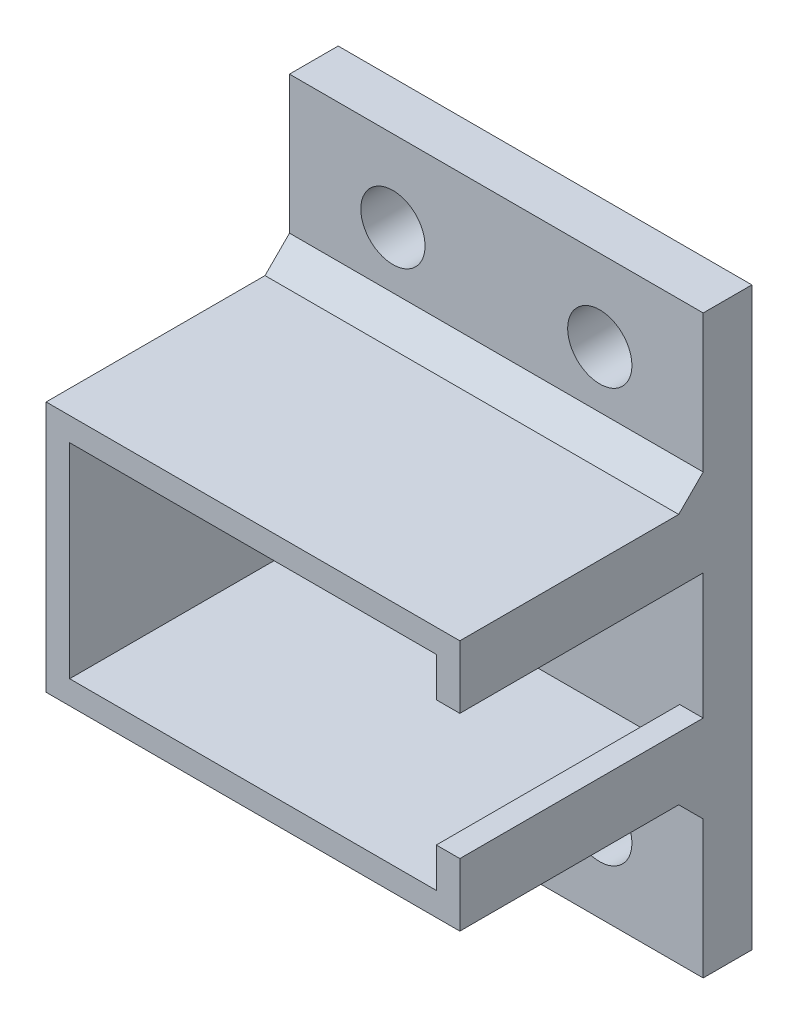
ISO-10303-21;
HEADER;
FILE_DESCRIPTION(('STEP AP214'),'2;1');
FILE_NAME('part.step','',(''),(''),'','','');
FILE_SCHEMA(('AUTOMOTIVE_DESIGN { 1 0 10303 214 1 1 1 1 }'));
ENDSEC;
DATA;
#1=APPLICATION_CONTEXT('core data for automotive mechanical design processes');
#2=APPLICATION_PROTOCOL_DEFINITION('international standard','automotive_design',2000,#1);
#3=PRODUCT_CONTEXT('',#1,'mechanical');
#4=PRODUCT('Part','Part','',(#3));
#5=PRODUCT_RELATED_PRODUCT_CATEGORY('part','',(#4));
#6=PRODUCT_DEFINITION_FORMATION('','',#4);
#7=PRODUCT_DEFINITION_CONTEXT('part definition',#1,'design');
#8=PRODUCT_DEFINITION('design','',#6,#7);
#9=PRODUCT_DEFINITION_SHAPE('','',#8);
#10=(LENGTH_UNIT() NAMED_UNIT(*) SI_UNIT(.MILLI.,.METRE.));
#11=(NAMED_UNIT(*) PLANE_ANGLE_UNIT() SI_UNIT($,.RADIAN.));
#12=(NAMED_UNIT(*) SI_UNIT($,.STERADIAN.) SOLID_ANGLE_UNIT());
#13=UNCERTAINTY_MEASURE_WITH_UNIT(LENGTH_MEASURE(1.E-05),#10,'distance_accuracy_value','');
#14=(GEOMETRIC_REPRESENTATION_CONTEXT(3) GLOBAL_UNCERTAINTY_ASSIGNED_CONTEXT((#13)) GLOBAL_UNIT_ASSIGNED_CONTEXT((#10,
#11,#12)) REPRESENTATION_CONTEXT('',''));
#15=CARTESIAN_POINT('',(0.,0.,0.));
#16=DIRECTION('',(0.,0.,1.));
#17=DIRECTION('',(1.,0.,0.));
#18=AXIS2_PLACEMENT_3D('',#15,#16,#17);
#19=CARTESIAN_POINT('',(24.0500037428116,14.0499916348984,3.));
#20=DIRECTION('',(1.,0.,0.));
#21=DIRECTION('',(0.,0.,-1.));
#22=AXIS2_PLACEMENT_3D('',#19,#20,#21);
#23=PLANE('',#22);
#24=DIRECTION('',(0.,1.,0.));
#25=VECTOR('',#24,1.);
#26=CARTESIAN_POINT('',(24.0500037428116,14.0499916348984,3.));
#27=LINE('',#26,#25);
#28=CARTESIAN_POINT('',(24.0500037428116,11.625,3.));
#29=VERTEX_POINT('',#28);
#30=CARTESIAN_POINT('',(24.0500037428116,14.0499916348984,3.));
#31=VERTEX_POINT('',#30);
#32=EDGE_CURVE('E253',#29,#31,#27,.T.);
#33=ORIENTED_EDGE('',*,*,#32,.F.);
#34=DIRECTION('',(0.,0.,1.));
#35=VECTOR('',#34,1.);
#36=CARTESIAN_POINT('',(24.0500037428116,11.625,3.));
#37=LINE('',#36,#35);
#38=CARTESIAN_POINT('',(24.0500037428116,11.625,18.));
#39=VERTEX_POINT('',#38);
#40=EDGE_CURVE('E164',#29,#39,#37,.T.);
#41=ORIENTED_EDGE('',*,*,#40,.T.);
#42=DIRECTION('',(0.,1.,0.));
#43=VECTOR('',#42,1.);
#44=CARTESIAN_POINT('',(24.0500037428116,14.0499916348984,18.));
#45=LINE('',#44,#43);
#46=CARTESIAN_POINT('',(24.0500037428116,14.0499916348984,18.));
#47=VERTEX_POINT('',#46);
#48=EDGE_CURVE('E250',#39,#47,#45,.T.);
#49=ORIENTED_EDGE('',*,*,#48,.T.);
#50=DIRECTION('',(0.,0.,1.));
#51=VECTOR('',#50,1.);
#52=CARTESIAN_POINT('',(24.0500037428116,14.0499916348984,3.));
#53=LINE('',#52,#51);
#54=EDGE_CURVE('E261',#31,#47,#53,.T.);
#55=ORIENTED_EDGE('',*,*,#54,.F.);
#56=EDGE_LOOP('',(#33,#41,#49,#55));
#57=FACE_BOUND('',#56,.T.);
#58=ADVANCED_FACE('F32',(#57),#23,.F.);
#59=CARTESIAN_POINT('',(0.,0.,18.));
#60=DIRECTION('',(0.,1.,0.));
#61=DIRECTION('',(-1.,0.,0.));
#62=AXIS2_PLACEMENT_3D('',#59,#60,#61);
#63=PLANE('',#62);
#64=DIRECTION('',(0.,0.,-1.));
#65=VECTOR('',#64,1.);
#66=CARTESIAN_POINT('',(0.,0.,18.));
#67=LINE('',#66,#65);
#68=CARTESIAN_POINT('',(0.,0.,18.));
#69=VERTEX_POINT('',#68);
#70=CARTESIAN_POINT('',(0.,0.,4.50999999999994));
#71=VERTEX_POINT('',#70);
#72=EDGE_CURVE('E294',#69,#71,#67,.T.);
#73=ORIENTED_EDGE('',*,*,#72,.T.);
#74=DIRECTION('',(-1.,0.,0.));
#75=VECTOR('',#74,1.);
#76=CARTESIAN_POINT('',(25.5,0.,4.50999999999994));
#77=LINE('',#76,#75);
#78=CARTESIAN_POINT('',(25.5,0.,4.50999999999994));
#79=VERTEX_POINT('',#78);
#80=EDGE_CURVE('E192',#79,#71,#77,.T.);
#81=ORIENTED_EDGE('',*,*,#80,.F.);
#82=DIRECTION('',(0.,0.,-1.));
#83=VECTOR('',#82,1.);
#84=CARTESIAN_POINT('',(25.5,0.,18.));
#85=LINE('',#84,#83);
#86=CARTESIAN_POINT('',(25.5,0.,18.));
#87=VERTEX_POINT('',#86);
#88=EDGE_CURVE('E11',#87,#79,#85,.T.);
#89=ORIENTED_EDGE('',*,*,#88,.F.);
#90=DIRECTION('',(1.,0.,0.));
#91=VECTOR('',#90,1.);
#92=CARTESIAN_POINT('',(0.,0.,18.));
#93=LINE('',#92,#91);
#94=EDGE_CURVE('E283',#69,#87,#93,.T.);
#95=ORIENTED_EDGE('',*,*,#94,.F.);
#96=EDGE_LOOP('',(#73,#81,#89,#95));
#97=FACE_BOUND('',#96,.T.);
#98=ADVANCED_FACE('F34',(#97),#63,.F.);
#99=CARTESIAN_POINT('',(0.,15.5,18.));
#100=DIRECTION('',(0.,-1.,0.));
#101=DIRECTION('',(1.,0.,0.));
#102=AXIS2_PLACEMENT_3D('',#99,#100,#101);
#103=PLANE('',#102);
#104=DIRECTION('',(0.,0.,-1.));
#105=VECTOR('',#104,1.);
#106=CARTESIAN_POINT('',(25.5,15.5,18.));
#107=LINE('',#106,#105);
#108=CARTESIAN_POINT('',(25.5,15.5,18.));
#109=VERTEX_POINT('',#108);
#110=CARTESIAN_POINT('',(25.5,15.5,4.51000000000003));
#111=VERTEX_POINT('',#110);
#112=EDGE_CURVE('E41',#109,#111,#107,.T.);
#113=ORIENTED_EDGE('',*,*,#112,.T.);
#114=DIRECTION('',(-1.,0.,0.));
#115=VECTOR('',#114,1.);
#116=CARTESIAN_POINT('',(25.5,15.5,4.51000000000003));
#117=LINE('',#116,#115);
#118=CARTESIAN_POINT('',(0.,15.5,4.51000000000003));
#119=VERTEX_POINT('',#118);
#120=EDGE_CURVE('E198',#111,#119,#117,.T.);
#121=ORIENTED_EDGE('',*,*,#120,.T.);
#122=DIRECTION('',(0.,0.,-1.));
#123=VECTOR('',#122,1.);
#124=CARTESIAN_POINT('',(0.,15.5,18.));
#125=LINE('',#124,#123);
#126=CARTESIAN_POINT('',(0.,15.5,18.));
#127=VERTEX_POINT('',#126);
#128=EDGE_CURVE('E299',#127,#119,#125,.T.);
#129=ORIENTED_EDGE('',*,*,#128,.F.);
#130=DIRECTION('',(-1.,0.,0.));
#131=VECTOR('',#130,1.);
#132=CARTESIAN_POINT('',(0.,15.5,18.));
#133=LINE('',#132,#131);
#134=EDGE_CURVE('E290',#109,#127,#133,.T.);
#135=ORIENTED_EDGE('',*,*,#134,.F.);
#136=EDGE_LOOP('',(#113,#121,#129,#135));
#137=FACE_BOUND('',#136,.T.);
#138=ADVANCED_FACE('F351',(#137),#103,.F.);
#139=CARTESIAN_POINT('',(25.5,0.,18.));
#140=DIRECTION('',(-1.,0.,0.));
#141=DIRECTION('',(0.,0.,1.));
#142=AXIS2_PLACEMENT_3D('',#139,#140,#141);
#143=PLANE('',#142);
#144=DIRECTION('',(0.,1.,0.));
#145=VECTOR('',#144,1.);
#146=CARTESIAN_POINT('',(25.5,0.,18.));
#147=LINE('',#146,#145);
#148=CARTESIAN_POINT('',(25.5,11.625,18.));
#149=VERTEX_POINT('',#148);
#150=EDGE_CURVE('E286',#149,#109,#147,.T.);
#151=ORIENTED_EDGE('',*,*,#150,.F.);
#152=DIRECTION('',(0.,0.,-1.));
#153=VECTOR('',#152,1.);
#154=CARTESIAN_POINT('',(25.5,11.625,18.));
#155=LINE('',#154,#153);
#156=CARTESIAN_POINT('',(25.5,11.625,3.));
#157=VERTEX_POINT('',#156);
#158=EDGE_CURVE('E181',#149,#157,#155,.T.);
#159=ORIENTED_EDGE('',*,*,#158,.T.);
#160=DIRECTION('',(0.,-1.,0.));
#161=VECTOR('',#160,1.);
#162=CARTESIAN_POINT('',(25.5,0.,3.));
#163=LINE('',#162,#161);
#164=CARTESIAN_POINT('',(25.5,3.875,3.));
#165=VERTEX_POINT('',#164);
#166=EDGE_CURVE('E171',#157,#165,#163,.T.);
#167=ORIENTED_EDGE('',*,*,#166,.T.);
#168=DIRECTION('',(0.,0.,1.));
#169=VECTOR('',#168,1.);
#170=CARTESIAN_POINT('',(25.5,3.875,18.));
#171=LINE('',#170,#169);
#172=CARTESIAN_POINT('',(25.5,3.875,18.));
#173=VERTEX_POINT('',#172);
#174=EDGE_CURVE('E157',#165,#173,#171,.T.);
#175=ORIENTED_EDGE('',*,*,#174,.T.);
#176=EDGE_CURVE('E288',#87,#173,#147,.T.);
#177=ORIENTED_EDGE('',*,*,#176,.F.);
#178=ORIENTED_EDGE('',*,*,#88,.T.);
#179=DIRECTION('',(0.,0.707106781186561,0.707106781186534));
#180=VECTOR('',#179,1.);
#181=CARTESIAN_POINT('',(25.5,-1.51,3.));
#182=LINE('',#181,#180);
#183=CARTESIAN_POINT('',(25.5,-1.51,3.));
#184=VERTEX_POINT('',#183);
#185=EDGE_CURVE('E185',#184,#79,#182,.T.);
#186=ORIENTED_EDGE('',*,*,#185,.F.);
#187=DIRECTION('',(0.,1.,0.));
#188=VECTOR('',#187,1.);
#189=CARTESIAN_POINT('',(25.5,-10.,3.));
#190=LINE('',#189,#188);
#191=CARTESIAN_POINT('',(25.5,-10.,3.));
#192=VERTEX_POINT('',#191);
#193=EDGE_CURVE('E243',#192,#184,#190,.T.);
#194=ORIENTED_EDGE('',*,*,#193,.F.);
#195=DIRECTION('',(0.,0.,1.));
#196=VECTOR('',#195,1.);
#197=CARTESIAN_POINT('',(25.5,-10.,0.));
#198=LINE('',#197,#196);
#199=CARTESIAN_POINT('',(25.5,-10.,0.));
#200=VERTEX_POINT('',#199);
#201=EDGE_CURVE('E240',#200,#192,#198,.T.);
#202=ORIENTED_EDGE('',*,*,#201,.F.);
#203=DIRECTION('',(0.,1.,0.));
#204=VECTOR('',#203,1.);
#205=CARTESIAN_POINT('',(25.5,0.,0.));
#206=LINE('',#205,#204);
#207=CARTESIAN_POINT('',(25.5,25.5,0.));
#208=VERTEX_POINT('',#207);
#209=EDGE_CURVE('E276',#200,#208,#206,.T.);
#210=ORIENTED_EDGE('',*,*,#209,.T.);
#211=DIRECTION('',(0.,0.,1.));
#212=VECTOR('',#211,1.);
#213=CARTESIAN_POINT('',(25.5,25.5,0.));
#214=LINE('',#213,#212);
#215=CARTESIAN_POINT('',(25.5,25.5,3.));
#216=VERTEX_POINT('',#215);
#217=EDGE_CURVE('E228',#208,#216,#214,.T.);
#218=ORIENTED_EDGE('',*,*,#217,.T.);
#219=CARTESIAN_POINT('',(25.5,17.01,3.));
#220=VERTEX_POINT('',#219);
#221=EDGE_CURVE('E242',#220,#216,#190,.T.);
#222=ORIENTED_EDGE('',*,*,#221,.F.);
#223=DIRECTION('',(0.,0.707106781186539,-0.707106781186556));
#224=VECTOR('',#223,1.);
#225=CARTESIAN_POINT('',(25.5,17.01,3.));
#226=LINE('',#225,#224);
#227=EDGE_CURVE('E196',#111,#220,#226,.T.);
#228=ORIENTED_EDGE('',*,*,#227,.F.);
#229=ORIENTED_EDGE('',*,*,#112,.F.);
#230=EDGE_LOOP('',(#151,#159,#167,#175,#177,#178,#186,#194,#202,#210,#218,#222,#228,#229));
#231=FACE_BOUND('',#230,.T.);
#232=ADVANCED_FACE('F180',(#231),#143,.F.);
#233=CARTESIAN_POINT('',(0.,0.,18.));
#234=DIRECTION('',(1.,0.,0.));
#235=DIRECTION('',(0.,0.,-1.));
#236=AXIS2_PLACEMENT_3D('',#233,#234,#235);
#237=PLANE('',#236);
#238=ORIENTED_EDGE('',*,*,#128,.T.);
#239=DIRECTION('',(0.,0.707106781186539,-0.707106781186556));
#240=VECTOR('',#239,1.);
#241=CARTESIAN_POINT('',(0.,17.01,3.));
#242=LINE('',#241,#240);
#243=CARTESIAN_POINT('',(0.,17.01,3.));
#244=VERTEX_POINT('',#243);
#245=EDGE_CURVE('E57',#119,#244,#242,.T.);
#246=ORIENTED_EDGE('',*,*,#245,.T.);
#247=DIRECTION('',(0.,1.,0.));
#248=VECTOR('',#247,1.);
#249=CARTESIAN_POINT('',(0.,-10.,3.));
#250=LINE('',#249,#248);
#251=CARTESIAN_POINT('',(0.,25.5,3.));
#252=VERTEX_POINT('',#251);
#253=EDGE_CURVE('E246',#244,#252,#250,.T.);
#254=ORIENTED_EDGE('',*,*,#253,.T.);
#255=DIRECTION('',(0.,0.,-1.));
#256=VECTOR('',#255,1.);
#257=CARTESIAN_POINT('',(0.,25.5,0.));
#258=LINE('',#257,#256);
#259=CARTESIAN_POINT('',(0.,25.5,0.));
#260=VERTEX_POINT('',#259);
#261=EDGE_CURVE('E222',#252,#260,#258,.T.);
#262=ORIENTED_EDGE('',*,*,#261,.T.);
#263=DIRECTION('',(0.,-1.,0.));
#264=VECTOR('',#263,1.);
#265=CARTESIAN_POINT('',(0.,0.,0.));
#266=LINE('',#265,#264);
#267=CARTESIAN_POINT('',(0.,-10.,0.));
#268=VERTEX_POINT('',#267);
#269=EDGE_CURVE('E287',#260,#268,#266,.T.);
#270=ORIENTED_EDGE('',*,*,#269,.T.);
#271=DIRECTION('',(0.,0.,-1.));
#272=VECTOR('',#271,1.);
#273=CARTESIAN_POINT('',(0.,-10.,0.));
#274=LINE('',#273,#272);
#275=CARTESIAN_POINT('',(0.,-10.,3.));
#276=VERTEX_POINT('',#275);
#277=EDGE_CURVE('E234',#276,#268,#274,.T.);
#278=ORIENTED_EDGE('',*,*,#277,.F.);
#279=CARTESIAN_POINT('',(0.,-1.51,3.));
#280=VERTEX_POINT('',#279);
#281=EDGE_CURVE('E247',#276,#280,#250,.T.);
#282=ORIENTED_EDGE('',*,*,#281,.T.);
#283=DIRECTION('',(0.,0.707106781186561,0.707106781186534));
#284=VECTOR('',#283,1.);
#285=CARTESIAN_POINT('',(0.,-1.51,3.));
#286=LINE('',#285,#284);
#287=EDGE_CURVE('E182',#280,#71,#286,.T.);
#288=ORIENTED_EDGE('',*,*,#287,.T.);
#289=ORIENTED_EDGE('',*,*,#72,.F.);
#290=DIRECTION('',(0.,-1.,0.));
#291=VECTOR('',#290,1.);
#292=CARTESIAN_POINT('',(0.,0.,18.));
#293=LINE('',#292,#291);
#294=EDGE_CURVE('E292',#127,#69,#293,.T.);
#295=ORIENTED_EDGE('',*,*,#294,.F.);
#296=EDGE_LOOP('',(#238,#246,#254,#262,#270,#278,#282,#288,#289,#295));
#297=FACE_BOUND('',#296,.T.);
#298=ADVANCED_FACE('F324',(#297),#237,.F.);
#299=CARTESIAN_POINT('',(0.,0.,18.));
#300=DIRECTION('',(0.,0.,1.));
#301=DIRECTION('',(1.,0.,0.));
#302=AXIS2_PLACEMENT_3D('',#299,#300,#301);
#303=PLANE('',#302);
#304=DIRECTION('',(1.,0.,0.));
#305=VECTOR('',#304,1.);
#306=CARTESIAN_POINT('',(16.5,11.625,18.));
#307=LINE('',#306,#305);
#308=EDGE_CURVE('E398',#39,#149,#307,.T.);
#309=ORIENTED_EDGE('',*,*,#308,.T.);
#310=ORIENTED_EDGE('',*,*,#150,.T.);
#311=ORIENTED_EDGE('',*,*,#134,.T.);
#312=ORIENTED_EDGE('',*,*,#294,.T.);
#313=ORIENTED_EDGE('',*,*,#94,.T.);
#314=ORIENTED_EDGE('',*,*,#176,.T.);
#315=DIRECTION('',(1.,0.,0.));
#316=VECTOR('',#315,1.);
#317=CARTESIAN_POINT('',(16.5,3.875,18.));
#318=LINE('',#317,#316);
#319=CARTESIAN_POINT('',(24.0500037428116,3.875,18.));
#320=VERTEX_POINT('',#319);
#321=EDGE_CURVE('E160',#320,#173,#318,.T.);
#322=ORIENTED_EDGE('',*,*,#321,.F.);
#323=CARTESIAN_POINT('',(24.0500037428116,1.44999163489811,18.));
#324=VERTEX_POINT('',#323);
#325=EDGE_CURVE('E262',#324,#320,#45,.T.);
#326=ORIENTED_EDGE('',*,*,#325,.F.);
#327=DIRECTION('',(1.,0.,0.));
#328=VECTOR('',#327,1.);
#329=CARTESIAN_POINT('',(24.0500037428116,1.44999163489811,18.));
#330=LINE('',#329,#328);
#331=CARTESIAN_POINT('',(1.45000374281136,1.44999163489811,18.));
#332=VERTEX_POINT('',#331);
#333=EDGE_CURVE('E271',#332,#324,#330,.T.);
#334=ORIENTED_EDGE('',*,*,#333,.F.);
#335=DIRECTION('',(0.,-1.,0.));
#336=VECTOR('',#335,1.);
#337=CARTESIAN_POINT('',(1.45000374281136,14.0499916348984,18.));
#338=LINE('',#337,#336);
#339=CARTESIAN_POINT('',(1.45000374281136,14.0499916348984,18.));
#340=VERTEX_POINT('',#339);
#341=EDGE_CURVE('E268',#340,#332,#338,.T.);
#342=ORIENTED_EDGE('',*,*,#341,.F.);
#343=DIRECTION('',(-1.,0.,0.));
#344=VECTOR('',#343,1.);
#345=CARTESIAN_POINT('',(24.0500037428116,14.0499916348984,18.));
#346=LINE('',#345,#344);
#347=EDGE_CURVE('E265',#47,#340,#346,.T.);
#348=ORIENTED_EDGE('',*,*,#347,.F.);
#349=ORIENTED_EDGE('',*,*,#48,.F.);
#350=EDGE_LOOP('',(#309,#310,#311,#312,#313,#314,#322,#326,#334,#342,#348,#349));
#351=FACE_BOUND('',#350,.T.);
#352=ADVANCED_FACE('F347',(#351),#303,.T.);
#353=CARTESIAN_POINT('',(0.,0.,0.));
#354=DIRECTION('',(0.,0.,1.));
#355=DIRECTION('',(1.,0.,0.));
#356=AXIS2_PLACEMENT_3D('',#353,#354,#355);
#357=PLANE('',#356);
#358=CARTESIAN_POINT('',(19.125,-5.,0.));
#359=DIRECTION('',(0.,0.,1.));
#360=DIRECTION('',(1.,0.,0.));
#361=AXIS2_PLACEMENT_3D('',#358,#359,#360);
#362=CIRCLE('',#361,1.98);
#363=CARTESIAN_POINT('',(21.105,-5.,0.));
#364=VERTEX_POINT('',#363);
#365=EDGE_CURVE('E209',#364,#364,#362,.F.);
#366=ORIENTED_EDGE('',*,*,#365,.F.);
#367=EDGE_LOOP('',(#366));
#368=FACE_BOUND('',#367,.T.);
#369=CARTESIAN_POINT('',(6.375,20.5,0.));
#370=DIRECTION('',(0.,0.,1.));
#371=DIRECTION('',(1.,0.,0.));
#372=AXIS2_PLACEMENT_3D('',#369,#370,#371);
#373=CIRCLE('',#372,1.98);
#374=CARTESIAN_POINT('',(8.355,20.5,0.));
#375=VERTEX_POINT('',#374);
#376=EDGE_CURVE('E216',#375,#375,#373,.F.);
#377=ORIENTED_EDGE('',*,*,#376,.F.);
#378=EDGE_LOOP('',(#377));
#379=FACE_BOUND('',#378,.T.);
#380=CARTESIAN_POINT('',(6.375,-5.,0.));
#381=DIRECTION('',(0.,0.,1.));
#382=DIRECTION('',(1.,0.,0.));
#383=AXIS2_PLACEMENT_3D('',#380,#381,#382);
#384=CIRCLE('',#383,1.98);
#385=CARTESIAN_POINT('',(8.355,-5.,0.));
#386=VERTEX_POINT('',#385);
#387=EDGE_CURVE('E205',#386,#386,#384,.F.);
#388=ORIENTED_EDGE('',*,*,#387,.F.);
#389=EDGE_LOOP('',(#388));
#390=FACE_BOUND('',#389,.T.);
#391=CARTESIAN_POINT('',(19.125,20.5,0.));
#392=DIRECTION('',(0.,0.,1.));
#393=DIRECTION('',(1.,0.,0.));
#394=AXIS2_PLACEMENT_3D('',#391,#392,#393);
#395=CIRCLE('',#394,1.98);
#396=CARTESIAN_POINT('',(21.105,20.5,0.));
#397=VERTEX_POINT('',#396);
#398=EDGE_CURVE('E213',#397,#397,#395,.F.);
#399=ORIENTED_EDGE('',*,*,#398,.F.);
#400=EDGE_LOOP('',(#399));
#401=FACE_BOUND('',#400,.T.);
#402=ORIENTED_EDGE('',*,*,#209,.F.);
#403=DIRECTION('',(1.,0.,0.));
#404=VECTOR('',#403,1.);
#405=CARTESIAN_POINT('',(0.,-10.,0.));
#406=LINE('',#405,#404);
#407=EDGE_CURVE('E237',#268,#200,#406,.T.);
#408=ORIENTED_EDGE('',*,*,#407,.F.);
#409=ORIENTED_EDGE('',*,*,#269,.F.);
#410=DIRECTION('',(1.,0.,0.));
#411=VECTOR('',#410,1.);
#412=CARTESIAN_POINT('',(0.,25.5,0.));
#413=LINE('',#412,#411);
#414=EDGE_CURVE('E225',#260,#208,#413,.T.);
#415=ORIENTED_EDGE('',*,*,#414,.T.);
#416=EDGE_LOOP('',(#402,#408,#409,#415));
#417=FACE_BOUND('',#416,.T.);
#418=ADVANCED_FACE('F329',(#368,#379,#390,#401,#417),#357,.F.);
#419=ORIENTED_EDGE('',*,*,#325,.T.);
#420=DIRECTION('',(0.,0.,-1.));
#421=VECTOR('',#420,1.);
#422=CARTESIAN_POINT('',(24.0500037428116,3.875,3.));
#423=LINE('',#422,#421);
#424=CARTESIAN_POINT('',(24.0500037428116,3.875,3.));
#425=VERTEX_POINT('',#424);
#426=EDGE_CURVE('E165',#320,#425,#423,.T.);
#427=ORIENTED_EDGE('',*,*,#426,.T.);
#428=CARTESIAN_POINT('',(24.0500037428116,1.44999163489811,3.));
#429=VERTEX_POINT('',#428);
#430=EDGE_CURVE('E175',#429,#425,#27,.T.);
#431=ORIENTED_EDGE('',*,*,#430,.F.);
#432=DIRECTION('',(0.,0.,1.));
#433=VECTOR('',#432,1.);
#434=CARTESIAN_POINT('',(24.0500037428116,1.44999163489811,3.));
#435=LINE('',#434,#433);
#436=EDGE_CURVE('E274',#429,#324,#435,.T.);
#437=ORIENTED_EDGE('',*,*,#436,.T.);
#438=EDGE_LOOP('',(#419,#427,#431,#437));
#439=FACE_BOUND('',#438,.T.);
#440=ADVANCED_FACE('F373',(#439),#23,.F.);
#441=CARTESIAN_POINT('',(24.0500037428116,1.44999163489811,3.));
#442=DIRECTION('',(0.,-1.,0.));
#443=DIRECTION('',(0.,0.,-1.));
#444=AXIS2_PLACEMENT_3D('',#441,#442,#443);
#445=PLANE('',#444);
#446=ORIENTED_EDGE('',*,*,#333,.T.);
#447=ORIENTED_EDGE('',*,*,#436,.F.);
#448=DIRECTION('',(1.,0.,0.));
#449=VECTOR('',#448,1.);
#450=CARTESIAN_POINT('',(24.0500037428116,1.44999163489811,3.));
#451=LINE('',#450,#449);
#452=CARTESIAN_POINT('',(1.45000374281136,1.44999163489811,3.));
#453=VERTEX_POINT('',#452);
#454=EDGE_CURVE('E259',#453,#429,#451,.T.);
#455=ORIENTED_EDGE('',*,*,#454,.F.);
#456=DIRECTION('',(0.,0.,1.));
#457=VECTOR('',#456,1.);
#458=CARTESIAN_POINT('',(1.45000374281136,1.44999163489811,3.));
#459=LINE('',#458,#457);
#460=EDGE_CURVE('E277',#453,#332,#459,.T.);
#461=ORIENTED_EDGE('',*,*,#460,.T.);
#462=EDGE_LOOP('',(#446,#447,#455,#461));
#463=FACE_BOUND('',#462,.T.);
#464=ADVANCED_FACE('F382',(#463),#445,.F.);
#465=CARTESIAN_POINT('',(1.45000374281136,14.0499916348984,3.));
#466=DIRECTION('',(-1.,0.,0.));
#467=DIRECTION('',(0.,-1.,0.));
#468=AXIS2_PLACEMENT_3D('',#465,#466,#467);
#469=PLANE('',#468);
#470=ORIENTED_EDGE('',*,*,#341,.T.);
#471=ORIENTED_EDGE('',*,*,#460,.F.);
#472=DIRECTION('',(0.,-1.,0.));
#473=VECTOR('',#472,1.);
#474=CARTESIAN_POINT('',(1.45000374281136,14.0499916348984,3.));
#475=LINE('',#474,#473);
#476=CARTESIAN_POINT('',(1.45000374281136,14.0499916348984,3.));
#477=VERTEX_POINT('',#476);
#478=EDGE_CURVE('E256',#477,#453,#475,.T.);
#479=ORIENTED_EDGE('',*,*,#478,.F.);
#480=DIRECTION('',(0.,0.,1.));
#481=VECTOR('',#480,1.);
#482=CARTESIAN_POINT('',(1.45000374281136,14.0499916348984,3.));
#483=LINE('',#482,#481);
#484=EDGE_CURVE('E279',#477,#340,#483,.T.);
#485=ORIENTED_EDGE('',*,*,#484,.T.);
#486=EDGE_LOOP('',(#470,#471,#479,#485));
#487=FACE_BOUND('',#486,.T.);
#488=ADVANCED_FACE('F389',(#487),#469,.F.);
#489=CARTESIAN_POINT('',(24.0500037428116,14.0499916348984,3.));
#490=DIRECTION('',(0.,1.,0.));
#491=DIRECTION('',(0.,0.,1.));
#492=AXIS2_PLACEMENT_3D('',#489,#490,#491);
#493=PLANE('',#492);
#494=ORIENTED_EDGE('',*,*,#347,.T.);
#495=ORIENTED_EDGE('',*,*,#484,.F.);
#496=DIRECTION('',(-1.,0.,0.));
#497=VECTOR('',#496,1.);
#498=CARTESIAN_POINT('',(24.0500037428116,14.0499916348984,3.));
#499=LINE('',#498,#497);
#500=EDGE_CURVE('E252',#31,#477,#499,.T.);
#501=ORIENTED_EDGE('',*,*,#500,.F.);
#502=ORIENTED_EDGE('',*,*,#54,.T.);
#503=EDGE_LOOP('',(#494,#495,#501,#502));
#504=FACE_BOUND('',#503,.T.);
#505=ADVANCED_FACE('F408',(#504),#493,.F.);
#506=CARTESIAN_POINT('',(0.,0.,3.));
#507=DIRECTION('',(0.,0.,-1.));
#508=DIRECTION('',(-1.,0.,0.));
#509=AXIS2_PLACEMENT_3D('',#506,#507,#508);
#510=PLANE('',#509);
#511=ORIENTED_EDGE('',*,*,#430,.T.);
#512=DIRECTION('',(1.,0.,0.));
#513=VECTOR('',#512,1.);
#514=CARTESIAN_POINT('',(16.5,3.875,3.));
#515=LINE('',#514,#513);
#516=EDGE_CURVE('E49',#425,#165,#515,.T.);
#517=ORIENTED_EDGE('',*,*,#516,.T.);
#518=ORIENTED_EDGE('',*,*,#166,.F.);
#519=DIRECTION('',(1.,0.,0.));
#520=VECTOR('',#519,1.);
#521=CARTESIAN_POINT('',(16.5,11.625,3.));
#522=LINE('',#521,#520);
#523=EDGE_CURVE('E176',#29,#157,#522,.T.);
#524=ORIENTED_EDGE('',*,*,#523,.F.);
#525=ORIENTED_EDGE('',*,*,#32,.T.);
#526=ORIENTED_EDGE('',*,*,#500,.T.);
#527=ORIENTED_EDGE('',*,*,#478,.T.);
#528=ORIENTED_EDGE('',*,*,#454,.T.);
#529=EDGE_LOOP('',(#511,#517,#518,#524,#525,#526,#527,#528));
#530=FACE_BOUND('',#529,.T.);
#531=ADVANCED_FACE('F169',(#530),#510,.F.);
#532=CARTESIAN_POINT('',(0.,25.5,0.));
#533=DIRECTION('',(0.,-1.,0.));
#534=DIRECTION('',(1.,0.,0.));
#535=AXIS2_PLACEMENT_3D('',#532,#533,#534);
#536=PLANE('',#535);
#537=DIRECTION('',(-1.,0.,0.));
#538=VECTOR('',#537,1.);
#539=CARTESIAN_POINT('',(0.,25.5,3.));
#540=LINE('',#539,#538);
#541=EDGE_CURVE('E219',#216,#252,#540,.T.);
#542=ORIENTED_EDGE('',*,*,#541,.F.);
#543=ORIENTED_EDGE('',*,*,#217,.F.);
#544=ORIENTED_EDGE('',*,*,#414,.F.);
#545=ORIENTED_EDGE('',*,*,#261,.F.);
#546=EDGE_LOOP('',(#542,#543,#544,#545));
#547=FACE_BOUND('',#546,.T.);
#548=ADVANCED_FACE('F316',(#547),#536,.F.);
#549=CARTESIAN_POINT('',(0.,-10.,3.));
#550=DIRECTION('',(0.,0.,-1.));
#551=DIRECTION('',(-1.,0.,0.));
#552=AXIS2_PLACEMENT_3D('',#549,#550,#551);
#553=PLANE('',#552);
#554=CARTESIAN_POINT('',(6.375,20.5,3.));
#555=DIRECTION('',(0.,0.,-1.));
#556=DIRECTION('',(-1.,0.,0.));
#557=AXIS2_PLACEMENT_3D('',#554,#555,#556);
#558=CIRCLE('',#557,1.98);
#559=CARTESIAN_POINT('',(4.395,20.5,3.));
#560=VERTEX_POINT('',#559);
#561=EDGE_CURVE('E36',#560,#560,#558,.F.);
#562=ORIENTED_EDGE('',*,*,#561,.F.);
#563=EDGE_LOOP('',(#562));
#564=FACE_BOUND('',#563,.T.);
#565=CARTESIAN_POINT('',(19.125,20.5,3.));
#566=DIRECTION('',(0.,0.,-1.));
#567=DIRECTION('',(-1.,0.,0.));
#568=AXIS2_PLACEMENT_3D('',#565,#566,#567);
#569=CIRCLE('',#568,1.98);
#570=CARTESIAN_POINT('',(17.145,20.5,3.));
#571=VERTEX_POINT('',#570);
#572=EDGE_CURVE('E212',#571,#571,#569,.F.);
#573=ORIENTED_EDGE('',*,*,#572,.F.);
#574=EDGE_LOOP('',(#573));
#575=FACE_BOUND('',#574,.T.);
#576=ORIENTED_EDGE('',*,*,#253,.F.);
#577=DIRECTION('',(-1.,0.,0.));
#578=VECTOR('',#577,1.);
#579=CARTESIAN_POINT('',(25.5,17.01,3.));
#580=LINE('',#579,#578);
#581=EDGE_CURVE('E200',#220,#244,#580,.T.);
#582=ORIENTED_EDGE('',*,*,#581,.F.);
#583=ORIENTED_EDGE('',*,*,#221,.T.);
#584=ORIENTED_EDGE('',*,*,#541,.T.);
#585=EDGE_LOOP('',(#576,#582,#583,#584));
#586=FACE_BOUND('',#585,.T.);
#587=ADVANCED_FACE('F312',(#564,#575,#586),#553,.F.);
#588=CARTESIAN_POINT('',(19.125,-5.,3.));
#589=DIRECTION('',(0.,0.,-1.));
#590=DIRECTION('',(-1.,0.,0.));
#591=AXIS2_PLACEMENT_3D('',#588,#589,#590);
#592=CIRCLE('',#591,1.98);
#593=CARTESIAN_POINT('',(17.145,-5.,3.));
#594=VERTEX_POINT('',#593);
#595=EDGE_CURVE('E208',#594,#594,#592,.F.);
#596=ORIENTED_EDGE('',*,*,#595,.F.);
#597=EDGE_LOOP('',(#596));
#598=FACE_BOUND('',#597,.T.);
#599=CARTESIAN_POINT('',(6.375,-5.,3.));
#600=DIRECTION('',(0.,0.,-1.));
#601=DIRECTION('',(-1.,0.,0.));
#602=AXIS2_PLACEMENT_3D('',#599,#600,#601);
#603=CIRCLE('',#602,1.98);
#604=CARTESIAN_POINT('',(4.395,-5.,3.));
#605=VERTEX_POINT('',#604);
#606=EDGE_CURVE('E202',#605,#605,#603,.F.);
#607=ORIENTED_EDGE('',*,*,#606,.F.);
#608=EDGE_LOOP('',(#607));
#609=FACE_BOUND('',#608,.T.);
#610=ORIENTED_EDGE('',*,*,#193,.T.);
#611=DIRECTION('',(-1.,0.,0.));
#612=VECTOR('',#611,1.);
#613=CARTESIAN_POINT('',(25.5,-1.51,3.));
#614=LINE('',#613,#612);
#615=EDGE_CURVE('E190',#184,#280,#614,.T.);
#616=ORIENTED_EDGE('',*,*,#615,.T.);
#617=ORIENTED_EDGE('',*,*,#281,.F.);
#618=DIRECTION('',(-1.,0.,0.));
#619=VECTOR('',#618,1.);
#620=CARTESIAN_POINT('',(0.,-10.,3.));
#621=LINE('',#620,#619);
#622=EDGE_CURVE('E231',#192,#276,#621,.T.);
#623=ORIENTED_EDGE('',*,*,#622,.F.);
#624=EDGE_LOOP('',(#610,#616,#617,#623));
#625=FACE_BOUND('',#624,.T.);
#626=ADVANCED_FACE('F315',(#598,#609,#625),#553,.F.);
#627=CARTESIAN_POINT('',(0.,-10.,0.));
#628=DIRECTION('',(0.,-1.,0.));
#629=DIRECTION('',(1.,0.,0.));
#630=AXIS2_PLACEMENT_3D('',#627,#628,#629);
#631=PLANE('',#630);
#632=ORIENTED_EDGE('',*,*,#622,.T.);
#633=ORIENTED_EDGE('',*,*,#277,.T.);
#634=ORIENTED_EDGE('',*,*,#407,.T.);
#635=ORIENTED_EDGE('',*,*,#201,.T.);
#636=EDGE_LOOP('',(#632,#633,#634,#635));
#637=FACE_BOUND('',#636,.T.);
#638=ADVANCED_FACE('F332',(#637),#631,.T.);
#639=CARTESIAN_POINT('',(6.375,-5.,18.));
#640=DIRECTION('',(0.,0.,-1.));
#641=DIRECTION('',(-1.,0.,0.));
#642=AXIS2_PLACEMENT_3D('',#639,#640,#641);
#643=CYLINDRICAL_SURFACE('',#642,1.98);
#644=ORIENTED_EDGE('',*,*,#606,.T.);
#645=EDGE_LOOP('',(#644));
#646=FACE_BOUND('',#645,.T.);
#647=ORIENTED_EDGE('',*,*,#387,.T.);
#648=EDGE_LOOP('',(#647));
#649=FACE_BOUND('',#648,.T.);
#650=ADVANCED_FACE('F425',(#646,#649),#643,.F.);
#651=CARTESIAN_POINT('',(19.125,-5.,18.));
#652=DIRECTION('',(0.,0.,-1.));
#653=DIRECTION('',(-1.,0.,0.));
#654=AXIS2_PLACEMENT_3D('',#651,#652,#653);
#655=CYLINDRICAL_SURFACE('',#654,1.98);
#656=ORIENTED_EDGE('',*,*,#595,.T.);
#657=EDGE_LOOP('',(#656));
#658=FACE_BOUND('',#657,.T.);
#659=ORIENTED_EDGE('',*,*,#365,.T.);
#660=EDGE_LOOP('',(#659));
#661=FACE_BOUND('',#660,.T.);
#662=ADVANCED_FACE('F430',(#658,#661),#655,.F.);
#663=CARTESIAN_POINT('',(19.125,20.5,18.));
#664=DIRECTION('',(0.,0.,-1.));
#665=DIRECTION('',(-1.,0.,0.));
#666=AXIS2_PLACEMENT_3D('',#663,#664,#665);
#667=CYLINDRICAL_SURFACE('',#666,1.98);
#668=ORIENTED_EDGE('',*,*,#572,.T.);
#669=EDGE_LOOP('',(#668));
#670=FACE_BOUND('',#669,.T.);
#671=ORIENTED_EDGE('',*,*,#398,.T.);
#672=EDGE_LOOP('',(#671));
#673=FACE_BOUND('',#672,.T.);
#674=ADVANCED_FACE('F309',(#670,#673),#667,.F.);
#675=CARTESIAN_POINT('',(6.375,20.5,18.));
#676=DIRECTION('',(0.,0.,-1.));
#677=DIRECTION('',(-1.,0.,0.));
#678=AXIS2_PLACEMENT_3D('',#675,#676,#677);
#679=CYLINDRICAL_SURFACE('',#678,1.98);
#680=ORIENTED_EDGE('',*,*,#561,.T.);
#681=EDGE_LOOP('',(#680));
#682=FACE_BOUND('',#681,.T.);
#683=ORIENTED_EDGE('',*,*,#376,.T.);
#684=EDGE_LOOP('',(#683));
#685=FACE_BOUND('',#684,.T.);
#686=ADVANCED_FACE('F368',(#682,#685),#679,.F.);
#687=CARTESIAN_POINT('',(25.5,17.01,3.));
#688=DIRECTION('',(0.,0.707106781186556,0.707106781186539));
#689=DIRECTION('',(0.,-0.707106781186539,0.707106781186556));
#690=AXIS2_PLACEMENT_3D('',#687,#688,#689);
#691=PLANE('',#690);
#692=ORIENTED_EDGE('',*,*,#245,.F.);
#693=ORIENTED_EDGE('',*,*,#120,.F.);
#694=ORIENTED_EDGE('',*,*,#227,.T.);
#695=ORIENTED_EDGE('',*,*,#581,.T.);
#696=EDGE_LOOP('',(#692,#693,#694,#695));
#697=FACE_BOUND('',#696,.T.);
#698=ADVANCED_FACE('F355',(#697),#691,.T.);
#699=CARTESIAN_POINT('',(25.5,-1.51,3.));
#700=DIRECTION('',(0.,-0.707106781186534,0.707106781186561));
#701=DIRECTION('',(0.,-0.707106781186561,-0.707106781186534));
#702=AXIS2_PLACEMENT_3D('',#699,#700,#701);
#703=PLANE('',#702);
#704=ORIENTED_EDGE('',*,*,#287,.F.);
#705=ORIENTED_EDGE('',*,*,#615,.F.);
#706=ORIENTED_EDGE('',*,*,#185,.T.);
#707=ORIENTED_EDGE('',*,*,#80,.T.);
#708=EDGE_LOOP('',(#704,#705,#706,#707));
#709=FACE_BOUND('',#708,.T.);
#710=ADVANCED_FACE('F357',(#709),#703,.T.);
#711=CARTESIAN_POINT('',(16.5,11.625,18.));
#712=DIRECTION('',(0.,1.,0.));
#713=DIRECTION('',(0.,0.,1.));
#714=AXIS2_PLACEMENT_3D('',#711,#712,#713);
#715=PLANE('',#714);
#716=ORIENTED_EDGE('',*,*,#308,.F.);
#717=ORIENTED_EDGE('',*,*,#40,.F.);
#718=ORIENTED_EDGE('',*,*,#523,.T.);
#719=ORIENTED_EDGE('',*,*,#158,.F.);
#720=EDGE_LOOP('',(#716,#717,#718,#719));
#721=FACE_BOUND('',#720,.T.);
#722=ADVANCED_FACE('F359',(#721),#715,.F.);
#723=CARTESIAN_POINT('',(16.5,3.875,3.));
#724=DIRECTION('',(0.,-1.,0.));
#725=DIRECTION('',(0.,0.,-1.));
#726=AXIS2_PLACEMENT_3D('',#723,#724,#725);
#727=PLANE('',#726);
#728=ORIENTED_EDGE('',*,*,#516,.F.);
#729=ORIENTED_EDGE('',*,*,#426,.F.);
#730=ORIENTED_EDGE('',*,*,#321,.T.);
#731=ORIENTED_EDGE('',*,*,#174,.F.);
#732=EDGE_LOOP('',(#728,#729,#730,#731));
#733=FACE_BOUND('',#732,.T.);
#734=ADVANCED_FACE('F158',(#733),#727,.F.);
#735=CLOSED_SHELL('',(#58,#98,#138,#232,#298,#352,#418,#440,#464,#488,#505,#531,#548,#587,#626,
#638,#650,#662,#674,#686,#698,#710,#722,#734));
#736=MANIFOLD_SOLID_BREP('B2',#735);
#737=ADVANCED_BREP_SHAPE_REPRESENTATION('',(#18,#736),#14);
#738=SHAPE_DEFINITION_REPRESENTATION(#9,#737);
ENDSEC;
END-ISO-10303-21;
